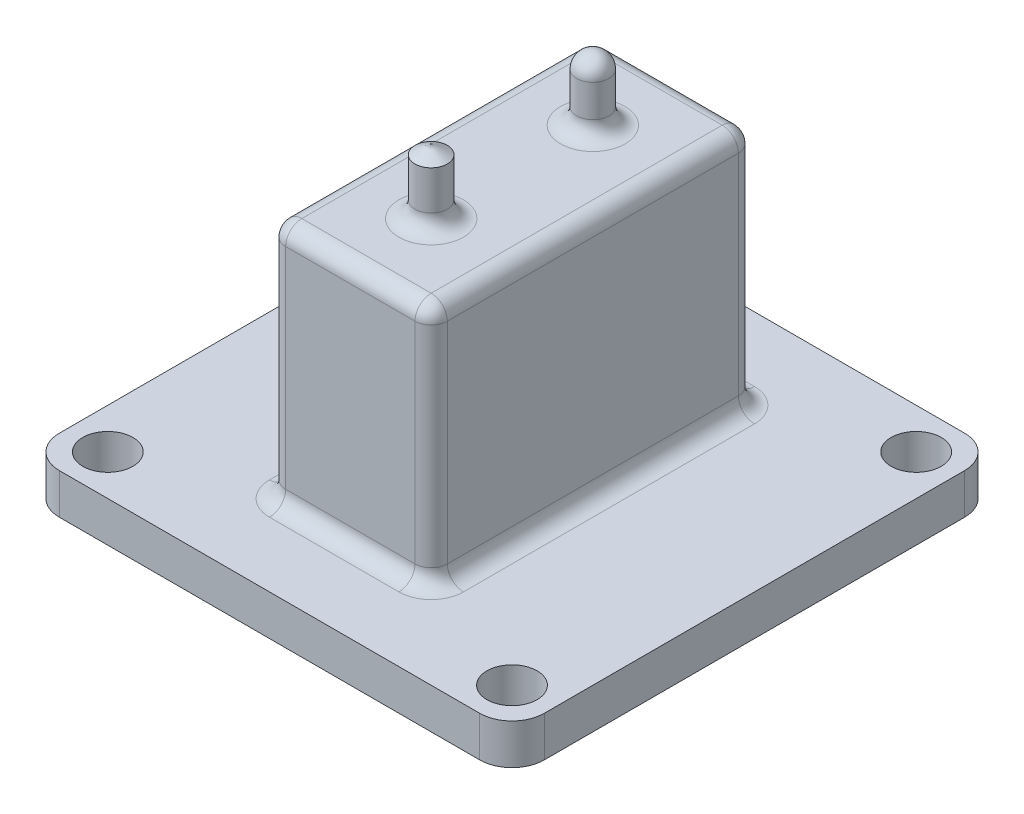
ISO-10303-21;
HEADER;
FILE_DESCRIPTION(('STEP AP214'),'2;1');
FILE_NAME('part.step','',(''),(''),'','','');
FILE_SCHEMA(('AUTOMOTIVE_DESIGN { 1 0 10303 214 1 1 1 1 }'));
ENDSEC;
DATA;
#1=APPLICATION_CONTEXT('core data for automotive mechanical design processes');
#2=APPLICATION_PROTOCOL_DEFINITION('international standard','automotive_design',2000,#1);
#3=PRODUCT_CONTEXT('',#1,'mechanical');
#4=PRODUCT('Part','Part','',(#3));
#5=PRODUCT_RELATED_PRODUCT_CATEGORY('part','',(#4));
#6=PRODUCT_DEFINITION_FORMATION('','',#4);
#7=PRODUCT_DEFINITION_CONTEXT('part definition',#1,'design');
#8=PRODUCT_DEFINITION('design','',#6,#7);
#9=PRODUCT_DEFINITION_SHAPE('','',#8);
#10=(LENGTH_UNIT() NAMED_UNIT(*) SI_UNIT(.MILLI.,.METRE.));
#11=(NAMED_UNIT(*) PLANE_ANGLE_UNIT() SI_UNIT($,.RADIAN.));
#12=(NAMED_UNIT(*) SI_UNIT($,.STERADIAN.) SOLID_ANGLE_UNIT());
#13=UNCERTAINTY_MEASURE_WITH_UNIT(LENGTH_MEASURE(1.E-05),#10,'distance_accuracy_value','');
#14=(GEOMETRIC_REPRESENTATION_CONTEXT(3) GLOBAL_UNCERTAINTY_ASSIGNED_CONTEXT((#13)) GLOBAL_UNIT_ASSIGNED_CONTEXT((#10,
#11,#12)) REPRESENTATION_CONTEXT('',''));
#15=CARTESIAN_POINT('',(0.,0.,0.));
#16=DIRECTION('',(0.,0.,1.));
#17=DIRECTION('',(1.,0.,0.));
#18=AXIS2_PLACEMENT_3D('',#15,#16,#17);
#19=CARTESIAN_POINT('',(0.,5.,0.));
#20=DIRECTION('',(0.,-1.,0.));
#21=DIRECTION('',(0.,0.,-1.));
#22=AXIS2_PLACEMENT_3D('',#19,#20,#21);
#23=PLANE('',#22);
#24=DIRECTION('',(0.,0.,-1.));
#25=VECTOR('',#24,1.);
#26=CARTESIAN_POINT('',(30.,5.,30.));
#27=LINE('',#26,#25);
#28=CARTESIAN_POINT('',(30.,5.,26.));
#29=VERTEX_POINT('',#28);
#30=CARTESIAN_POINT('',(30.,5.,-26.));
#31=VERTEX_POINT('',#30);
#32=EDGE_CURVE('E242',#29,#31,#27,.T.);
#33=ORIENTED_EDGE('',*,*,#32,.T.);
#34=CARTESIAN_POINT('',(26.,5.,-26.));
#35=DIRECTION('',(0.,-1.,0.));
#36=DIRECTION('',(0.,0.,-1.));
#37=AXIS2_PLACEMENT_3D('',#34,#35,#36);
#38=CIRCLE('',#37,4.);
#39=CARTESIAN_POINT('',(26.,5.,-30.));
#40=VERTEX_POINT('',#39);
#41=EDGE_CURVE('E328',#31,#40,#38,.F.);
#42=ORIENTED_EDGE('',*,*,#41,.T.);
#43=DIRECTION('',(-1.,0.,0.));
#44=VECTOR('',#43,1.);
#45=CARTESIAN_POINT('',(-30.,5.,-30.));
#46=LINE('',#45,#44);
#47=CARTESIAN_POINT('',(-26.,5.,-30.));
#48=VERTEX_POINT('',#47);
#49=EDGE_CURVE('E246',#40,#48,#46,.T.);
#50=ORIENTED_EDGE('',*,*,#49,.T.);
#51=CARTESIAN_POINT('',(-26.,5.,-26.));
#52=DIRECTION('',(0.,-1.,0.));
#53=DIRECTION('',(0.,0.,-1.));
#54=AXIS2_PLACEMENT_3D('',#51,#52,#53);
#55=CIRCLE('',#54,4.);
#56=CARTESIAN_POINT('',(-30.,5.,-26.));
#57=VERTEX_POINT('',#56);
#58=EDGE_CURVE('E325',#48,#57,#55,.F.);
#59=ORIENTED_EDGE('',*,*,#58,.T.);
#60=DIRECTION('',(0.,0.,1.));
#61=VECTOR('',#60,1.);
#62=CARTESIAN_POINT('',(-30.,5.,30.));
#63=LINE('',#62,#61);
#64=CARTESIAN_POINT('',(-30.,5.,26.));
#65=VERTEX_POINT('',#64);
#66=EDGE_CURVE('E251',#57,#65,#63,.T.);
#67=ORIENTED_EDGE('',*,*,#66,.T.);
#68=CARTESIAN_POINT('',(-26.,5.,26.));
#69=DIRECTION('',(0.,-1.,0.));
#70=DIRECTION('',(0.,0.,-1.));
#71=AXIS2_PLACEMENT_3D('',#68,#69,#70);
#72=CIRCLE('',#71,4.);
#73=CARTESIAN_POINT('',(-26.,5.,30.));
#74=VERTEX_POINT('',#73);
#75=EDGE_CURVE('E322',#65,#74,#72,.F.);
#76=ORIENTED_EDGE('',*,*,#75,.T.);
#77=DIRECTION('',(1.,0.,0.));
#78=VECTOR('',#77,1.);
#79=CARTESIAN_POINT('',(-30.,5.,30.));
#80=LINE('',#79,#78);
#81=CARTESIAN_POINT('',(26.,5.,30.));
#82=VERTEX_POINT('',#81);
#83=EDGE_CURVE('E255',#74,#82,#80,.T.);
#84=ORIENTED_EDGE('',*,*,#83,.T.);
#85=CARTESIAN_POINT('',(26.,5.,26.));
#86=DIRECTION('',(0.,-1.,0.));
#87=DIRECTION('',(0.,0.,-1.));
#88=AXIS2_PLACEMENT_3D('',#85,#86,#87);
#89=CIRCLE('',#88,4.);
#90=EDGE_CURVE('E319',#82,#29,#89,.F.);
#91=ORIENTED_EDGE('',*,*,#90,.T.);
#92=EDGE_LOOP('',(#33,#42,#50,#59,#67,#76,#84,#91));
#93=FACE_BOUND('',#92,.T.);
#94=CARTESIAN_POINT('',(-25.,5.,-25.));
#95=DIRECTION('',(0.,1.,0.));
#96=DIRECTION('',(0.,0.,1.));
#97=AXIS2_PLACEMENT_3D('',#94,#95,#96);
#98=CIRCLE('',#97,3.1);
#99=CARTESIAN_POINT('',(-25.,5.,-21.9));
#100=VERTEX_POINT('',#99);
#101=EDGE_CURVE('E234',#100,#100,#98,.T.);
#102=ORIENTED_EDGE('',*,*,#101,.F.);
#103=EDGE_LOOP('',(#102));
#104=FACE_BOUND('',#103,.T.);
#105=CARTESIAN_POINT('',(-25.,5.,25.));
#106=DIRECTION('',(0.,1.,0.));
#107=DIRECTION('',(0.,0.,1.));
#108=AXIS2_PLACEMENT_3D('',#105,#106,#107);
#109=CIRCLE('',#108,3.1);
#110=CARTESIAN_POINT('',(-25.,5.,28.1));
#111=VERTEX_POINT('',#110);
#112=EDGE_CURVE('E226',#111,#111,#109,.T.);
#113=ORIENTED_EDGE('',*,*,#112,.F.);
#114=EDGE_LOOP('',(#113));
#115=FACE_BOUND('',#114,.T.);
#116=CARTESIAN_POINT('',(25.,5.,25.));
#117=DIRECTION('',(0.,1.,0.));
#118=DIRECTION('',(0.,0.,1.));
#119=AXIS2_PLACEMENT_3D('',#116,#117,#118);
#120=CIRCLE('',#119,3.1);
#121=CARTESIAN_POINT('',(25.,5.,28.1));
#122=VERTEX_POINT('',#121);
#123=EDGE_CURVE('E218',#122,#122,#120,.T.);
#124=ORIENTED_EDGE('',*,*,#123,.F.);
#125=EDGE_LOOP('',(#124));
#126=FACE_BOUND('',#125,.T.);
#127=CARTESIAN_POINT('',(25.,5.,-25.));
#128=DIRECTION('',(0.,1.,0.));
#129=DIRECTION('',(0.,0.,1.));
#130=AXIS2_PLACEMENT_3D('',#127,#128,#129);
#131=CIRCLE('',#130,3.1);
#132=CARTESIAN_POINT('',(25.,5.,-21.9));
#133=VERTEX_POINT('',#132);
#134=EDGE_CURVE('E209',#133,#133,#131,.T.);
#135=ORIENTED_EDGE('',*,*,#134,.F.);
#136=EDGE_LOOP('',(#135));
#137=FACE_BOUND('',#136,.T.);
#138=CARTESIAN_POINT('',(-8.,5.,18.));
#139=DIRECTION('',(0.,-1.,0.));
#140=DIRECTION('',(0.,0.,-1.));
#141=AXIS2_PLACEMENT_3D('',#138,#139,#140);
#142=CIRCLE('',#141,4.);
#143=CARTESIAN_POINT('',(-12.,5.,18.));
#144=VERTEX_POINT('',#143);
#145=CARTESIAN_POINT('',(-8.,5.,22.));
#146=VERTEX_POINT('',#145);
#147=EDGE_CURVE('E11',#144,#146,#142,.F.);
#148=ORIENTED_EDGE('',*,*,#147,.F.);
#149=DIRECTION('',(0.,0.,1.));
#150=VECTOR('',#149,1.);
#151=CARTESIAN_POINT('',(-12.,5.,-20.));
#152=LINE('',#151,#150);
#153=CARTESIAN_POINT('',(-12.,5.,-18.));
#154=VERTEX_POINT('',#153);
#155=EDGE_CURVE('E52',#144,#154,#152,.F.);
#156=ORIENTED_EDGE('',*,*,#155,.T.);
#157=CARTESIAN_POINT('',(-8.,5.,-18.));
#158=DIRECTION('',(0.,-1.,0.));
#159=DIRECTION('',(0.,0.,-1.));
#160=AXIS2_PLACEMENT_3D('',#157,#158,#159);
#161=CIRCLE('',#160,4.);
#162=CARTESIAN_POINT('',(-8.,5.,-22.));
#163=VERTEX_POINT('',#162);
#164=EDGE_CURVE('E66',#163,#154,#161,.F.);
#165=ORIENTED_EDGE('',*,*,#164,.F.);
#166=DIRECTION('',(-1.,0.,0.));
#167=VECTOR('',#166,1.);
#168=CARTESIAN_POINT('',(10.,5.,-22.));
#169=LINE('',#168,#167);
#170=CARTESIAN_POINT('',(8.,5.,-22.));
#171=VERTEX_POINT('',#170);
#172=EDGE_CURVE('E424',#163,#171,#169,.F.);
#173=ORIENTED_EDGE('',*,*,#172,.T.);
#174=CARTESIAN_POINT('',(8.,5.,-18.));
#175=DIRECTION('',(0.,-1.,0.));
#176=DIRECTION('',(0.,0.,-1.));
#177=AXIS2_PLACEMENT_3D('',#174,#175,#176);
#178=CIRCLE('',#177,4.);
#179=CARTESIAN_POINT('',(12.,5.,-18.));
#180=VERTEX_POINT('',#179);
#181=EDGE_CURVE('E420',#180,#171,#178,.F.);
#182=ORIENTED_EDGE('',*,*,#181,.F.);
#183=DIRECTION('',(0.,0.,-1.));
#184=VECTOR('',#183,1.);
#185=CARTESIAN_POINT('',(12.,5.,20.));
#186=LINE('',#185,#184);
#187=CARTESIAN_POINT('',(12.,5.,18.));
#188=VERTEX_POINT('',#187);
#189=EDGE_CURVE('E414',#180,#188,#186,.F.);
#190=ORIENTED_EDGE('',*,*,#189,.T.);
#191=CARTESIAN_POINT('',(8.,5.,18.));
#192=DIRECTION('',(0.,-1.,0.));
#193=DIRECTION('',(0.,0.,-1.));
#194=AXIS2_PLACEMENT_3D('',#191,#192,#193);
#195=CIRCLE('',#194,4.);
#196=CARTESIAN_POINT('',(8.,5.,22.));
#197=VERTEX_POINT('',#196);
#198=EDGE_CURVE('E410',#197,#188,#195,.F.);
#199=ORIENTED_EDGE('',*,*,#198,.F.);
#200=DIRECTION('',(1.,0.,0.));
#201=VECTOR('',#200,1.);
#202=CARTESIAN_POINT('',(-10.,5.,22.));
#203=LINE('',#202,#201);
#204=EDGE_CURVE('E417',#197,#146,#203,.F.);
#205=ORIENTED_EDGE('',*,*,#204,.T.);
#206=EDGE_LOOP('',(#148,#156,#165,#173,#182,#190,#199,#205));
#207=FACE_BOUND('',#206,.T.);
#208=ADVANCED_FACE('F42',(#93,#104,#115,#126,#137,#207),#23,.F.);
#209=CARTESIAN_POINT('',(0.,43.,10.));
#210=DIRECTION('',(0.,-1.,0.));
#211=DIRECTION('',(0.,0.,-1.));
#212=AXIS2_PLACEMENT_3D('',#209,#210,#211);
#213=CYLINDRICAL_SURFACE('',#212,2.);
#214=CARTESIAN_POINT('',(0.,37.,10.));
#215=DIRECTION('',(0.,-1.,0.));
#216=DIRECTION('',(0.,0.,-1.));
#217=AXIS2_PLACEMENT_3D('',#214,#215,#216);
#218=CIRCLE('',#217,2.);
#219=CARTESIAN_POINT('',(0.,37.,8.));
#220=VERTEX_POINT('',#219);
#221=EDGE_CURVE('E289',#220,#220,#218,.F.);
#222=ORIENTED_EDGE('',*,*,#221,.T.);
#223=EDGE_LOOP('',(#222));
#224=FACE_BOUND('',#223,.T.);
#225=CARTESIAN_POINT('',(0.,41.8452994616207,10.));
#226=DIRECTION('',(0.,-1.,0.));
#227=DIRECTION('',(0.,0.,-1.));
#228=AXIS2_PLACEMENT_3D('',#225,#226,#227);
#229=CIRCLE('',#228,2.);
#230=CARTESIAN_POINT('',(0.,41.8452994616207,8.));
#231=VERTEX_POINT('',#230);
#232=EDGE_CURVE('E201',#231,#231,#229,.T.);
#233=ORIENTED_EDGE('',*,*,#232,.T.);
#234=EDGE_LOOP('',(#233));
#235=FACE_BOUND('',#234,.T.);
#236=ADVANCED_FACE('F616',(#224,#235),#213,.T.);
#237=CARTESIAN_POINT('',(0.,0.,0.));
#238=DIRECTION('',(0.,-1.,0.));
#239=DIRECTION('',(0.,0.,-1.));
#240=AXIS2_PLACEMENT_3D('',#237,#238,#239);
#241=PLANE('',#240);
#242=CARTESIAN_POINT('',(25.,0.,25.));
#243=DIRECTION('',(0.,1.,0.));
#244=DIRECTION('',(0.,0.,1.));
#245=AXIS2_PLACEMENT_3D('',#242,#243,#244);
#246=CIRCLE('',#245,3.1);
#247=CARTESIAN_POINT('',(25.,0.,28.1));
#248=VERTEX_POINT('',#247);
#249=EDGE_CURVE('E216',#248,#248,#246,.T.);
#250=ORIENTED_EDGE('',*,*,#249,.T.);
#251=EDGE_LOOP('',(#250));
#252=FACE_BOUND('',#251,.T.);
#253=CARTESIAN_POINT('',(-25.,0.,-25.));
#254=DIRECTION('',(0.,1.,0.));
#255=DIRECTION('',(0.,0.,1.));
#256=AXIS2_PLACEMENT_3D('',#253,#254,#255);
#257=CIRCLE('',#256,3.1);
#258=CARTESIAN_POINT('',(-25.,0.,-21.9));
#259=VERTEX_POINT('',#258);
#260=EDGE_CURVE('E230',#259,#259,#257,.T.);
#261=ORIENTED_EDGE('',*,*,#260,.T.);
#262=EDGE_LOOP('',(#261));
#263=FACE_BOUND('',#262,.T.);
#264=DIRECTION('',(-1.,0.,0.));
#265=VECTOR('',#264,1.);
#266=CARTESIAN_POINT('',(-30.,0.,-30.));
#267=LINE('',#266,#265);
#268=CARTESIAN_POINT('',(26.,0.,-30.));
#269=VERTEX_POINT('',#268);
#270=CARTESIAN_POINT('',(-26.,0.,-30.));
#271=VERTEX_POINT('',#270);
#272=EDGE_CURVE('E263',#269,#271,#267,.T.);
#273=ORIENTED_EDGE('',*,*,#272,.F.);
#274=CARTESIAN_POINT('',(26.,0.,-26.));
#275=DIRECTION('',(0.,-1.,0.));
#276=DIRECTION('',(0.,0.,-1.));
#277=AXIS2_PLACEMENT_3D('',#274,#275,#276);
#278=CIRCLE('',#277,4.);
#279=CARTESIAN_POINT('',(30.,0.,-26.));
#280=VERTEX_POINT('',#279);
#281=EDGE_CURVE('E309',#269,#280,#278,.T.);
#282=ORIENTED_EDGE('',*,*,#281,.T.);
#283=DIRECTION('',(0.,0.,-1.));
#284=VECTOR('',#283,1.);
#285=CARTESIAN_POINT('',(30.,0.,30.));
#286=LINE('',#285,#284);
#287=CARTESIAN_POINT('',(30.,0.,26.));
#288=VERTEX_POINT('',#287);
#289=EDGE_CURVE('E238',#288,#280,#286,.T.);
#290=ORIENTED_EDGE('',*,*,#289,.F.);
#291=CARTESIAN_POINT('',(26.,0.,26.));
#292=DIRECTION('',(0.,-1.,0.));
#293=DIRECTION('',(0.,0.,-1.));
#294=AXIS2_PLACEMENT_3D('',#291,#292,#293);
#295=CIRCLE('',#294,4.);
#296=CARTESIAN_POINT('',(26.,0.,30.));
#297=VERTEX_POINT('',#296);
#298=EDGE_CURVE('E300',#288,#297,#295,.T.);
#299=ORIENTED_EDGE('',*,*,#298,.T.);
#300=DIRECTION('',(1.,0.,0.));
#301=VECTOR('',#300,1.);
#302=CARTESIAN_POINT('',(-30.,0.,30.));
#303=LINE('',#302,#301);
#304=CARTESIAN_POINT('',(-26.,0.,30.));
#305=VERTEX_POINT('',#304);
#306=EDGE_CURVE('E247',#305,#297,#303,.T.);
#307=ORIENTED_EDGE('',*,*,#306,.F.);
#308=CARTESIAN_POINT('',(-26.,0.,26.));
#309=DIRECTION('',(0.,-1.,0.));
#310=DIRECTION('',(0.,0.,-1.));
#311=AXIS2_PLACEMENT_3D('',#308,#309,#310);
#312=CIRCLE('',#311,4.);
#313=CARTESIAN_POINT('',(-30.,0.,26.));
#314=VERTEX_POINT('',#313);
#315=EDGE_CURVE('E303',#305,#314,#312,.T.);
#316=ORIENTED_EDGE('',*,*,#315,.T.);
#317=DIRECTION('',(0.,0.,1.));
#318=VECTOR('',#317,1.);
#319=CARTESIAN_POINT('',(-30.,0.,30.));
#320=LINE('',#319,#318);
#321=CARTESIAN_POINT('',(-30.,0.,-26.));
#322=VERTEX_POINT('',#321);
#323=EDGE_CURVE('E267',#322,#314,#320,.T.);
#324=ORIENTED_EDGE('',*,*,#323,.F.);
#325=CARTESIAN_POINT('',(-26.,0.,-26.));
#326=DIRECTION('',(0.,-1.,0.));
#327=DIRECTION('',(0.,0.,-1.));
#328=AXIS2_PLACEMENT_3D('',#325,#326,#327);
#329=CIRCLE('',#328,4.);
#330=EDGE_CURVE('E306',#322,#271,#329,.T.);
#331=ORIENTED_EDGE('',*,*,#330,.T.);
#332=EDGE_LOOP('',(#273,#282,#290,#299,#307,#316,#324,#331));
#333=FACE_BOUND('',#332,.T.);
#334=CARTESIAN_POINT('',(-25.,0.,25.));
#335=DIRECTION('',(0.,1.,0.));
#336=DIRECTION('',(0.,0.,1.));
#337=AXIS2_PLACEMENT_3D('',#334,#335,#336);
#338=CIRCLE('',#337,3.1);
#339=CARTESIAN_POINT('',(-25.,0.,28.1));
#340=VERTEX_POINT('',#339);
#341=EDGE_CURVE('E222',#340,#340,#338,.T.);
#342=ORIENTED_EDGE('',*,*,#341,.T.);
#343=EDGE_LOOP('',(#342));
#344=FACE_BOUND('',#343,.T.);
#345=CARTESIAN_POINT('',(25.,0.,-25.));
#346=DIRECTION('',(0.,1.,0.));
#347=DIRECTION('',(0.,0.,1.));
#348=AXIS2_PLACEMENT_3D('',#345,#346,#347);
#349=CIRCLE('',#348,3.1);
#350=CARTESIAN_POINT('',(25.,0.,-21.9));
#351=VERTEX_POINT('',#350);
#352=EDGE_CURVE('E204',#351,#351,#349,.T.);
#353=ORIENTED_EDGE('',*,*,#352,.T.);
#354=EDGE_LOOP('',(#353));
#355=FACE_BOUND('',#354,.T.);
#356=ADVANCED_FACE('F624',(#252,#263,#333,#344,#355),#241,.T.);
#357=CARTESIAN_POINT('',(30.,5.,30.));
#358=DIRECTION('',(-1.,0.,0.));
#359=DIRECTION('',(0.,0.,1.));
#360=AXIS2_PLACEMENT_3D('',#357,#358,#359);
#361=PLANE('',#360);
#362=ORIENTED_EDGE('',*,*,#289,.T.);
#363=DIRECTION('',(0.,-1.,0.));
#364=VECTOR('',#363,1.);
#365=CARTESIAN_POINT('',(30.,5.,-26.));
#366=LINE('',#365,#364);
#367=EDGE_CURVE('E316',#280,#31,#366,.F.);
#368=ORIENTED_EDGE('',*,*,#367,.T.);
#369=ORIENTED_EDGE('',*,*,#32,.F.);
#370=DIRECTION('',(0.,-1.,0.));
#371=VECTOR('',#370,1.);
#372=CARTESIAN_POINT('',(30.,5.,26.));
#373=LINE('',#372,#371);
#374=EDGE_CURVE('E312',#29,#288,#373,.T.);
#375=ORIENTED_EDGE('',*,*,#374,.T.);
#376=EDGE_LOOP('',(#362,#368,#369,#375));
#377=FACE_BOUND('',#376,.T.);
#378=ADVANCED_FACE('F634',(#377),#361,.F.);
#379=CARTESIAN_POINT('',(-30.,5.,-30.));
#380=DIRECTION('',(0.,0.,1.));
#381=DIRECTION('',(1.,0.,0.));
#382=AXIS2_PLACEMENT_3D('',#379,#380,#381);
#383=PLANE('',#382);
#384=ORIENTED_EDGE('',*,*,#49,.F.);
#385=DIRECTION('',(0.,-1.,0.));
#386=VECTOR('',#385,1.);
#387=CARTESIAN_POINT('',(26.,5.,-30.));
#388=LINE('',#387,#386);
#389=EDGE_CURVE('E296',#40,#269,#388,.T.);
#390=ORIENTED_EDGE('',*,*,#389,.T.);
#391=ORIENTED_EDGE('',*,*,#272,.T.);
#392=DIRECTION('',(0.,-1.,0.));
#393=VECTOR('',#392,1.);
#394=CARTESIAN_POINT('',(-26.,5.,-30.));
#395=LINE('',#394,#393);
#396=EDGE_CURVE('E293',#271,#48,#395,.F.);
#397=ORIENTED_EDGE('',*,*,#396,.T.);
#398=EDGE_LOOP('',(#384,#390,#391,#397));
#399=FACE_BOUND('',#398,.T.);
#400=ADVANCED_FACE('F643',(#399),#383,.F.);
#401=CARTESIAN_POINT('',(-30.,5.,30.));
#402=DIRECTION('',(1.,0.,0.));
#403=DIRECTION('',(0.,0.,-1.));
#404=AXIS2_PLACEMENT_3D('',#401,#402,#403);
#405=PLANE('',#404);
#406=ORIENTED_EDGE('',*,*,#66,.F.);
#407=DIRECTION('',(0.,-1.,0.));
#408=VECTOR('',#407,1.);
#409=CARTESIAN_POINT('',(-30.,5.,-26.));
#410=LINE('',#409,#408);
#411=EDGE_CURVE('E334',#57,#322,#410,.T.);
#412=ORIENTED_EDGE('',*,*,#411,.T.);
#413=ORIENTED_EDGE('',*,*,#323,.T.);
#414=DIRECTION('',(0.,-1.,0.));
#415=VECTOR('',#414,1.);
#416=CARTESIAN_POINT('',(-30.,5.,26.));
#417=LINE('',#416,#415);
#418=EDGE_CURVE('E331',#314,#65,#417,.F.);
#419=ORIENTED_EDGE('',*,*,#418,.T.);
#420=EDGE_LOOP('',(#406,#412,#413,#419));
#421=FACE_BOUND('',#420,.T.);
#422=ADVANCED_FACE('F639',(#421),#405,.F.);
#423=CARTESIAN_POINT('',(-30.,5.,30.));
#424=DIRECTION('',(0.,0.,-1.));
#425=DIRECTION('',(-1.,0.,0.));
#426=AXIS2_PLACEMENT_3D('',#423,#424,#425);
#427=PLANE('',#426);
#428=ORIENTED_EDGE('',*,*,#83,.F.);
#429=DIRECTION('',(0.,-1.,0.));
#430=VECTOR('',#429,1.);
#431=CARTESIAN_POINT('',(-26.,5.,30.));
#432=LINE('',#431,#430);
#433=EDGE_CURVE('E341',#74,#305,#432,.T.);
#434=ORIENTED_EDGE('',*,*,#433,.T.);
#435=ORIENTED_EDGE('',*,*,#306,.T.);
#436=DIRECTION('',(0.,-1.,0.));
#437=VECTOR('',#436,1.);
#438=CARTESIAN_POINT('',(26.,5.,30.));
#439=LINE('',#438,#437);
#440=EDGE_CURVE('E338',#297,#82,#439,.F.);
#441=ORIENTED_EDGE('',*,*,#440,.T.);
#442=EDGE_LOOP('',(#428,#434,#435,#441));
#443=FACE_BOUND('',#442,.T.);
#444=ADVANCED_FACE('F636',(#443),#427,.F.);
#445=CARTESIAN_POINT('',(-25.,5.,-25.));
#446=DIRECTION('',(0.,-1.,0.));
#447=DIRECTION('',(0.,0.,-1.));
#448=AXIS2_PLACEMENT_3D('',#445,#446,#447);
#449=CYLINDRICAL_SURFACE('',#448,3.1);
#450=ORIENTED_EDGE('',*,*,#101,.T.);
#451=EDGE_LOOP('',(#450));
#452=FACE_BOUND('',#451,.T.);
#453=ORIENTED_EDGE('',*,*,#260,.F.);
#454=EDGE_LOOP('',(#453));
#455=FACE_BOUND('',#454,.T.);
#456=ADVANCED_FACE('F630',(#452,#455),#449,.F.);
#457=CARTESIAN_POINT('',(-25.,5.,25.));
#458=DIRECTION('',(0.,-1.,0.));
#459=DIRECTION('',(0.,0.,-1.));
#460=AXIS2_PLACEMENT_3D('',#457,#458,#459);
#461=CYLINDRICAL_SURFACE('',#460,3.1);
#462=ORIENTED_EDGE('',*,*,#112,.T.);
#463=EDGE_LOOP('',(#462));
#464=FACE_BOUND('',#463,.T.);
#465=ORIENTED_EDGE('',*,*,#341,.F.);
#466=EDGE_LOOP('',(#465));
#467=FACE_BOUND('',#466,.T.);
#468=ADVANCED_FACE('F1001',(#464,#467),#461,.F.);
#469=CARTESIAN_POINT('',(25.,5.,25.));
#470=DIRECTION('',(0.,-1.,0.));
#471=DIRECTION('',(0.,0.,-1.));
#472=AXIS2_PLACEMENT_3D('',#469,#470,#471);
#473=CYLINDRICAL_SURFACE('',#472,3.1);
#474=ORIENTED_EDGE('',*,*,#123,.T.);
#475=EDGE_LOOP('',(#474));
#476=FACE_BOUND('',#475,.T.);
#477=ORIENTED_EDGE('',*,*,#249,.F.);
#478=EDGE_LOOP('',(#477));
#479=FACE_BOUND('',#478,.T.);
#480=ADVANCED_FACE('F990',(#476,#479),#473,.F.);
#481=CARTESIAN_POINT('',(25.,5.,-25.));
#482=DIRECTION('',(0.,-1.,0.));
#483=DIRECTION('',(0.,0.,-1.));
#484=AXIS2_PLACEMENT_3D('',#481,#482,#483);
#485=CYLINDRICAL_SURFACE('',#484,3.1);
#486=ORIENTED_EDGE('',*,*,#134,.T.);
#487=EDGE_LOOP('',(#486));
#488=FACE_BOUND('',#487,.T.);
#489=ORIENTED_EDGE('',*,*,#352,.F.);
#490=EDGE_LOOP('',(#489));
#491=FACE_BOUND('',#490,.T.);
#492=ADVANCED_FACE('F981',(#488,#491),#485,.F.);
#493=CARTESIAN_POINT('',(10.,35.,20.));
#494=DIRECTION('',(-1.,0.,0.));
#495=DIRECTION('',(0.,0.,1.));
#496=AXIS2_PLACEMENT_3D('',#493,#494,#495);
#497=PLANE('',#496);
#498=DIRECTION('',(0.,-1.,0.));
#499=VECTOR('',#498,1.);
#500=CARTESIAN_POINT('',(10.,35.,-18.));
#501=LINE('',#500,#499);
#502=CARTESIAN_POINT('',(10.,7.,-18.));
#503=VERTEX_POINT('',#502);
#504=CARTESIAN_POINT('',(10.,33.,-18.));
#505=VERTEX_POINT('',#504);
#506=EDGE_CURVE('E364',#503,#505,#501,.F.);
#507=ORIENTED_EDGE('',*,*,#506,.T.);
#508=DIRECTION('',(0.,0.,-1.));
#509=VECTOR('',#508,1.);
#510=CARTESIAN_POINT('',(10.,33.,20.));
#511=LINE('',#510,#509);
#512=CARTESIAN_POINT('',(10.,33.,18.));
#513=VERTEX_POINT('',#512);
#514=EDGE_CURVE('E368',#505,#513,#511,.F.);
#515=ORIENTED_EDGE('',*,*,#514,.T.);
#516=DIRECTION('',(0.,-1.,0.));
#517=VECTOR('',#516,1.);
#518=CARTESIAN_POINT('',(10.,35.,18.));
#519=LINE('',#518,#517);
#520=CARTESIAN_POINT('',(10.,7.,18.));
#521=VERTEX_POINT('',#520);
#522=EDGE_CURVE('E361',#513,#521,#519,.T.);
#523=ORIENTED_EDGE('',*,*,#522,.T.);
#524=DIRECTION('',(0.,0.,-1.));
#525=VECTOR('',#524,1.);
#526=CARTESIAN_POINT('',(10.,7.,-20.));
#527=LINE('',#526,#525);
#528=EDGE_CURVE('E358',#521,#503,#527,.T.);
#529=ORIENTED_EDGE('',*,*,#528,.T.);
#530=EDGE_LOOP('',(#507,#515,#523,#529));
#531=FACE_BOUND('',#530,.T.);
#532=ADVANCED_FACE('F594',(#531),#497,.F.);
#533=CARTESIAN_POINT('',(-10.,35.,-20.));
#534=DIRECTION('',(0.,0.,1.));
#535=DIRECTION('',(1.,0.,0.));
#536=AXIS2_PLACEMENT_3D('',#533,#534,#535);
#537=PLANE('',#536);
#538=DIRECTION('',(0.,-1.,0.));
#539=VECTOR('',#538,1.);
#540=CARTESIAN_POINT('',(-8.,35.,-20.));
#541=LINE('',#540,#539);
#542=CARTESIAN_POINT('',(-8.,7.,-20.));
#543=VERTEX_POINT('',#542);
#544=CARTESIAN_POINT('',(-8.,33.,-20.));
#545=VERTEX_POINT('',#544);
#546=EDGE_CURVE('E348',#543,#545,#541,.F.);
#547=ORIENTED_EDGE('',*,*,#546,.T.);
#548=DIRECTION('',(-1.,0.,0.));
#549=VECTOR('',#548,1.);
#550=CARTESIAN_POINT('',(-10.,33.,-20.));
#551=LINE('',#550,#549);
#552=CARTESIAN_POINT('',(8.,33.,-20.));
#553=VERTEX_POINT('',#552);
#554=EDGE_CURVE('E355',#545,#553,#551,.F.);
#555=ORIENTED_EDGE('',*,*,#554,.T.);
#556=DIRECTION('',(0.,-1.,0.));
#557=VECTOR('',#556,1.);
#558=CARTESIAN_POINT('',(8.,35.,-20.));
#559=LINE('',#558,#557);
#560=CARTESIAN_POINT('',(8.,7.,-20.));
#561=VERTEX_POINT('',#560);
#562=EDGE_CURVE('E351',#553,#561,#559,.T.);
#563=ORIENTED_EDGE('',*,*,#562,.T.);
#564=DIRECTION('',(-1.,0.,0.));
#565=VECTOR('',#564,1.);
#566=CARTESIAN_POINT('',(-10.,7.,-20.));
#567=LINE('',#566,#565);
#568=EDGE_CURVE('E345',#561,#543,#567,.T.);
#569=ORIENTED_EDGE('',*,*,#568,.T.);
#570=EDGE_LOOP('',(#547,#555,#563,#569));
#571=FACE_BOUND('',#570,.T.);
#572=ADVANCED_FACE('F586',(#571),#537,.F.);
#573=CARTESIAN_POINT('',(-10.,35.,20.));
#574=DIRECTION('',(1.,0.,0.));
#575=DIRECTION('',(0.,0.,-1.));
#576=AXIS2_PLACEMENT_3D('',#573,#574,#575);
#577=PLANE('',#576);
#578=DIRECTION('',(0.,-1.,0.));
#579=VECTOR('',#578,1.);
#580=CARTESIAN_POINT('',(-10.,35.,18.));
#581=LINE('',#580,#579);
#582=CARTESIAN_POINT('',(-10.,7.,18.));
#583=VERTEX_POINT('',#582);
#584=CARTESIAN_POINT('',(-10.,33.,18.));
#585=VERTEX_POINT('',#584);
#586=EDGE_CURVE('E374',#583,#585,#581,.F.);
#587=ORIENTED_EDGE('',*,*,#586,.T.);
#588=DIRECTION('',(0.,0.,1.));
#589=VECTOR('',#588,1.);
#590=CARTESIAN_POINT('',(-10.,33.,20.));
#591=LINE('',#590,#589);
#592=CARTESIAN_POINT('',(-10.,33.,-18.));
#593=VERTEX_POINT('',#592);
#594=EDGE_CURVE('E381',#585,#593,#591,.F.);
#595=ORIENTED_EDGE('',*,*,#594,.T.);
#596=DIRECTION('',(0.,-1.,0.));
#597=VECTOR('',#596,1.);
#598=CARTESIAN_POINT('',(-10.,35.,-18.));
#599=LINE('',#598,#597);
#600=CARTESIAN_POINT('',(-10.,7.,-18.));
#601=VERTEX_POINT('',#600);
#602=EDGE_CURVE('E377',#593,#601,#599,.T.);
#603=ORIENTED_EDGE('',*,*,#602,.T.);
#604=DIRECTION('',(0.,0.,1.));
#605=VECTOR('',#604,1.);
#606=CARTESIAN_POINT('',(-10.,7.,20.));
#607=LINE('',#606,#605);
#608=EDGE_CURVE('E371',#601,#583,#607,.T.);
#609=ORIENTED_EDGE('',*,*,#608,.T.);
#610=EDGE_LOOP('',(#587,#595,#603,#609));
#611=FACE_BOUND('',#610,.T.);
#612=ADVANCED_FACE('F579',(#611),#577,.F.);
#613=CARTESIAN_POINT('',(-10.,35.,20.));
#614=DIRECTION('',(0.,0.,-1.));
#615=DIRECTION('',(-1.,0.,0.));
#616=AXIS2_PLACEMENT_3D('',#613,#614,#615);
#617=PLANE('',#616);
#618=DIRECTION('',(0.,-1.,0.));
#619=VECTOR('',#618,1.);
#620=CARTESIAN_POINT('',(8.,35.,20.));
#621=LINE('',#620,#619);
#622=CARTESIAN_POINT('',(8.,7.,20.));
#623=VERTEX_POINT('',#622);
#624=CARTESIAN_POINT('',(8.,33.,20.));
#625=VERTEX_POINT('',#624);
#626=EDGE_CURVE('E387',#623,#625,#621,.F.);
#627=ORIENTED_EDGE('',*,*,#626,.T.);
#628=DIRECTION('',(1.,0.,0.));
#629=VECTOR('',#628,1.);
#630=CARTESIAN_POINT('',(-10.,33.,20.));
#631=LINE('',#630,#629);
#632=CARTESIAN_POINT('',(-8.,33.,20.));
#633=VERTEX_POINT('',#632);
#634=EDGE_CURVE('E394',#625,#633,#631,.F.);
#635=ORIENTED_EDGE('',*,*,#634,.T.);
#636=DIRECTION('',(0.,-1.,0.));
#637=VECTOR('',#636,1.);
#638=CARTESIAN_POINT('',(-8.,35.,20.));
#639=LINE('',#638,#637);
#640=CARTESIAN_POINT('',(-8.,7.,20.));
#641=VERTEX_POINT('',#640);
#642=EDGE_CURVE('E390',#633,#641,#639,.T.);
#643=ORIENTED_EDGE('',*,*,#642,.T.);
#644=DIRECTION('',(1.,0.,0.));
#645=VECTOR('',#644,1.);
#646=CARTESIAN_POINT('',(10.,7.,20.));
#647=LINE('',#646,#645);
#648=EDGE_CURVE('E384',#641,#623,#647,.T.);
#649=ORIENTED_EDGE('',*,*,#648,.T.);
#650=EDGE_LOOP('',(#627,#635,#643,#649));
#651=FACE_BOUND('',#650,.T.);
#652=ADVANCED_FACE('F553',(#651),#617,.F.);
#653=CARTESIAN_POINT('',(0.,35.,0.));
#654=DIRECTION('',(0.,-1.,0.));
#655=DIRECTION('',(0.,0.,-1.));
#656=AXIS2_PLACEMENT_3D('',#653,#654,#655);
#657=PLANE('',#656);
#658=DIRECTION('',(0.,0.,-1.));
#659=VECTOR('',#658,1.);
#660=CARTESIAN_POINT('',(8.,35.,0.));
#661=LINE('',#660,#659);
#662=CARTESIAN_POINT('',(8.,35.,18.));
#663=VERTEX_POINT('',#662);
#664=CARTESIAN_POINT('',(8.,35.,-18.));
#665=VERTEX_POINT('',#664);
#666=EDGE_CURVE('E397',#663,#665,#661,.T.);
#667=ORIENTED_EDGE('',*,*,#666,.T.);
#668=DIRECTION('',(-1.,0.,0.));
#669=VECTOR('',#668,1.);
#670=CARTESIAN_POINT('',(0.,35.,-18.));
#671=LINE('',#670,#669);
#672=CARTESIAN_POINT('',(-8.,35.,-18.));
#673=VERTEX_POINT('',#672);
#674=EDGE_CURVE('E406',#665,#673,#671,.T.);
#675=ORIENTED_EDGE('',*,*,#674,.T.);
#676=DIRECTION('',(0.,0.,1.));
#677=VECTOR('',#676,1.);
#678=CARTESIAN_POINT('',(-8.,35.,0.));
#679=LINE('',#678,#677);
#680=CARTESIAN_POINT('',(-8.,35.,18.));
#681=VERTEX_POINT('',#680);
#682=EDGE_CURVE('E403',#673,#681,#679,.T.);
#683=ORIENTED_EDGE('',*,*,#682,.T.);
#684=DIRECTION('',(1.,0.,0.));
#685=VECTOR('',#684,1.);
#686=CARTESIAN_POINT('',(0.,35.,18.));
#687=LINE('',#686,#685);
#688=EDGE_CURVE('E400',#681,#663,#687,.T.);
#689=ORIENTED_EDGE('',*,*,#688,.T.);
#690=EDGE_LOOP('',(#667,#675,#683,#689));
#691=FACE_BOUND('',#690,.T.);
#692=CARTESIAN_POINT('',(0.,35.,-10.));
#693=DIRECTION('',(0.,-1.,0.));
#694=DIRECTION('',(0.,0.,-1.));
#695=AXIS2_PLACEMENT_3D('',#692,#693,#694);
#696=CIRCLE('',#695,4.);
#697=CARTESIAN_POINT('',(0.,35.,-14.));
#698=VERTEX_POINT('',#697);
#699=EDGE_CURVE('E285',#698,#698,#696,.T.);
#700=ORIENTED_EDGE('',*,*,#699,.T.);
#701=EDGE_LOOP('',(#700));
#702=FACE_BOUND('',#701,.T.);
#703=CARTESIAN_POINT('',(0.,35.,10.));
#704=DIRECTION('',(0.,-1.,0.));
#705=DIRECTION('',(0.,0.,-1.));
#706=AXIS2_PLACEMENT_3D('',#703,#704,#705);
#707=CIRCLE('',#706,4.);
#708=CARTESIAN_POINT('',(0.,35.,6.));
#709=VERTEX_POINT('',#708);
#710=EDGE_CURVE('E281',#709,#709,#707,.T.);
#711=ORIENTED_EDGE('',*,*,#710,.T.);
#712=EDGE_LOOP('',(#711));
#713=FACE_BOUND('',#712,.T.);
#714=ADVANCED_FACE('F601',(#691,#702,#713),#657,.F.);
#715=CARTESIAN_POINT('',(0.,43.,-10.));
#716=DIRECTION('',(0.,-1.,0.));
#717=DIRECTION('',(0.,0.,-1.));
#718=AXIS2_PLACEMENT_3D('',#715,#716,#717);
#719=CYLINDRICAL_SURFACE('',#718,2.);
#720=CARTESIAN_POINT('',(0.,37.,-10.));
#721=DIRECTION('',(0.,-1.,0.));
#722=DIRECTION('',(0.,0.,-1.));
#723=AXIS2_PLACEMENT_3D('',#720,#721,#722);
#724=CIRCLE('',#723,2.);
#725=CARTESIAN_POINT('',(0.,37.,-12.));
#726=VERTEX_POINT('',#725);
#727=EDGE_CURVE('E277',#726,#726,#724,.F.);
#728=ORIENTED_EDGE('',*,*,#727,.T.);
#729=EDGE_LOOP('',(#728));
#730=FACE_BOUND('',#729,.T.);
#731=CARTESIAN_POINT('',(0.,41.,-10.));
#732=DIRECTION('',(0.,-1.,0.));
#733=DIRECTION('',(0.,0.,-1.));
#734=AXIS2_PLACEMENT_3D('',#731,#732,#733);
#735=CIRCLE('',#734,2.);
#736=CARTESIAN_POINT('',(0.,41.,-12.));
#737=VERTEX_POINT('',#736);
#738=EDGE_CURVE('E259',#737,#737,#735,.T.);
#739=ORIENTED_EDGE('',*,*,#738,.T.);
#740=EDGE_LOOP('',(#739));
#741=FACE_BOUND('',#740,.T.);
#742=ADVANCED_FACE('F655',(#730,#741),#719,.T.);
#743=CARTESIAN_POINT('',(0.,37.,-10.));
#744=DIRECTION('',(0.,-1.,0.));
#745=DIRECTION('',(0.,0.,-1.));
#746=AXIS2_PLACEMENT_3D('',#743,#744,#745);
#747=TOROIDAL_SURFACE('',#746,4.,2.);
#748=ORIENTED_EDGE('',*,*,#699,.F.);
#749=EDGE_LOOP('',(#748));
#750=FACE_BOUND('',#749,.T.);
#751=ORIENTED_EDGE('',*,*,#727,.F.);
#752=EDGE_LOOP('',(#751));
#753=FACE_BOUND('',#752,.T.);
#754=ADVANCED_FACE('F651',(#750,#753),#747,.F.);
#755=CARTESIAN_POINT('',(0.,37.,10.));
#756=DIRECTION('',(0.,-1.,0.));
#757=DIRECTION('',(0.,0.,-1.));
#758=AXIS2_PLACEMENT_3D('',#755,#756,#757);
#759=TOROIDAL_SURFACE('',#758,4.,2.);
#760=ORIENTED_EDGE('',*,*,#710,.F.);
#761=EDGE_LOOP('',(#760));
#762=FACE_BOUND('',#761,.T.);
#763=ORIENTED_EDGE('',*,*,#221,.F.);
#764=EDGE_LOOP('',(#763));
#765=FACE_BOUND('',#764,.T.);
#766=ADVANCED_FACE('F654',(#762,#765),#759,.F.);
#767=CARTESIAN_POINT('',(0.,41.,-10.));
#768=DIRECTION('',(0.,1.,0.));
#769=DIRECTION('',(0.,0.,1.));
#770=AXIS2_PLACEMENT_3D('',#767,#768,#769);
#771=SPHERICAL_SURFACE('',#770,2.);
#772=ORIENTED_EDGE('',*,*,#738,.F.);
#773=EDGE_LOOP('',(#772));
#774=FACE_BOUND('',#773,.T.);
#775=ADVANCED_FACE('F659',(#774),#771,.T.);
#776=CARTESIAN_POINT('',(26.,5.,-26.));
#777=DIRECTION('',(0.,-1.,0.));
#778=DIRECTION('',(0.,0.,-1.));
#779=AXIS2_PLACEMENT_3D('',#776,#777,#778);
#780=CYLINDRICAL_SURFACE('',#779,4.);
#781=ORIENTED_EDGE('',*,*,#41,.F.);
#782=ORIENTED_EDGE('',*,*,#367,.F.);
#783=ORIENTED_EDGE('',*,*,#281,.F.);
#784=ORIENTED_EDGE('',*,*,#389,.F.);
#785=EDGE_LOOP('',(#781,#782,#783,#784));
#786=FACE_BOUND('',#785,.T.);
#787=ADVANCED_FACE('F663',(#786),#780,.T.);
#788=CARTESIAN_POINT('',(-26.,5.,-26.));
#789=DIRECTION('',(0.,-1.,0.));
#790=DIRECTION('',(0.,0.,-1.));
#791=AXIS2_PLACEMENT_3D('',#788,#789,#790);
#792=CYLINDRICAL_SURFACE('',#791,4.);
#793=ORIENTED_EDGE('',*,*,#58,.F.);
#794=ORIENTED_EDGE('',*,*,#396,.F.);
#795=ORIENTED_EDGE('',*,*,#330,.F.);
#796=ORIENTED_EDGE('',*,*,#411,.F.);
#797=EDGE_LOOP('',(#793,#794,#795,#796));
#798=FACE_BOUND('',#797,.T.);
#799=ADVANCED_FACE('F667',(#798),#792,.T.);
#800=CARTESIAN_POINT('',(-26.,5.,26.));
#801=DIRECTION('',(0.,-1.,0.));
#802=DIRECTION('',(0.,0.,-1.));
#803=AXIS2_PLACEMENT_3D('',#800,#801,#802);
#804=CYLINDRICAL_SURFACE('',#803,4.);
#805=ORIENTED_EDGE('',*,*,#75,.F.);
#806=ORIENTED_EDGE('',*,*,#418,.F.);
#807=ORIENTED_EDGE('',*,*,#315,.F.);
#808=ORIENTED_EDGE('',*,*,#433,.F.);
#809=EDGE_LOOP('',(#805,#806,#807,#808));
#810=FACE_BOUND('',#809,.T.);
#811=ADVANCED_FACE('F671',(#810),#804,.T.);
#812=CARTESIAN_POINT('',(26.,5.,26.));
#813=DIRECTION('',(0.,-1.,0.));
#814=DIRECTION('',(0.,0.,-1.));
#815=AXIS2_PLACEMENT_3D('',#812,#813,#814);
#816=CYLINDRICAL_SURFACE('',#815,4.);
#817=ORIENTED_EDGE('',*,*,#90,.F.);
#818=ORIENTED_EDGE('',*,*,#440,.F.);
#819=ORIENTED_EDGE('',*,*,#298,.F.);
#820=ORIENTED_EDGE('',*,*,#374,.F.);
#821=EDGE_LOOP('',(#817,#818,#819,#820));
#822=FACE_BOUND('',#821,.T.);
#823=ADVANCED_FACE('F197',(#822),#816,.T.);
#824=CARTESIAN_POINT('',(0.,41.8452994616207,10.));
#825=DIRECTION('',(0.,-1.,0.));
#826=DIRECTION('',(0.,0.,-1.));
#827=AXIS2_PLACEMENT_3D('',#824,#825,#826);
#828=CONICAL_SURFACE('',#827,2.,1.0471975511966);
#829=CARTESIAN_POINT('',(0.,43.,10.));
#830=VERTEX_POINT('',#829);
#831=VERTEX_LOOP('',#830);
#832=FACE_BOUND('',#831,.T.);
#833=ORIENTED_EDGE('',*,*,#232,.F.);
#834=EDGE_LOOP('',(#833));
#835=FACE_BOUND('',#834,.T.);
#836=ADVANCED_FACE('F194',(#832,#835),#828,.T.);
#837=CARTESIAN_POINT('',(-8.,35.,18.));
#838=DIRECTION('',(0.,-1.,0.));
#839=DIRECTION('',(0.,0.,-1.));
#840=AXIS2_PLACEMENT_3D('',#837,#838,#839);
#841=CYLINDRICAL_SURFACE('',#840,2.);
#842=CARTESIAN_POINT('',(-8.,33.,18.));
#843=DIRECTION('',(0.,1.,0.));
#844=DIRECTION('',(0.,0.,1.));
#845=AXIS2_PLACEMENT_3D('',#842,#843,#844);
#846=CIRCLE('',#845,2.);
#847=EDGE_CURVE('E46',#585,#633,#846,.T.);
#848=ORIENTED_EDGE('',*,*,#847,.F.);
#849=ORIENTED_EDGE('',*,*,#586,.F.);
#850=CARTESIAN_POINT('',(-8.,7.,18.));
#851=DIRECTION('',(0.,-1.,0.));
#852=DIRECTION('',(0.,0.,-1.));
#853=AXIS2_PLACEMENT_3D('',#850,#851,#852);
#854=CIRCLE('',#853,2.);
#855=EDGE_CURVE('E212',#641,#583,#854,.T.);
#856=ORIENTED_EDGE('',*,*,#855,.F.);
#857=ORIENTED_EDGE('',*,*,#642,.F.);
#858=EDGE_LOOP('',(#848,#849,#856,#857));
#859=FACE_BOUND('',#858,.T.);
#860=ADVANCED_FACE('F44',(#859),#841,.T.);
#861=CARTESIAN_POINT('',(-8.,33.,18.));
#862=DIRECTION('',(0.,0.,1.));
#863=DIRECTION('',(1.,0.,0.));
#864=AXIS2_PLACEMENT_3D('',#861,#862,#863);
#865=SPHERICAL_SURFACE('',#864,2.);
#866=CARTESIAN_POINT('',(-8.,33.,18.));
#867=DIRECTION('',(0.,0.,1.));
#868=DIRECTION('',(1.,0.,0.));
#869=AXIS2_PLACEMENT_3D('',#866,#867,#868);
#870=CIRCLE('',#869,2.);
#871=EDGE_CURVE('E507',#585,#681,#870,.F.);
#872=ORIENTED_EDGE('',*,*,#871,.F.);
#873=ORIENTED_EDGE('',*,*,#847,.T.);
#874=CARTESIAN_POINT('',(-8.,33.,18.));
#875=DIRECTION('',(-1.,0.,0.));
#876=DIRECTION('',(0.,0.,1.));
#877=AXIS2_PLACEMENT_3D('',#874,#875,#876);
#878=CIRCLE('',#877,2.);
#879=EDGE_CURVE('E511',#681,#633,#878,.F.);
#880=ORIENTED_EDGE('',*,*,#879,.F.);
#881=EDGE_LOOP('',(#872,#873,#880));
#882=FACE_BOUND('',#881,.T.);
#883=ADVANCED_FACE('F571',(#882),#865,.T.);
#884=CARTESIAN_POINT('',(-8.,7.,18.));
#885=DIRECTION('',(0.,-1.,0.));
#886=DIRECTION('',(0.,0.,-1.));
#887=AXIS2_PLACEMENT_3D('',#884,#885,#886);
#888=TOROIDAL_SURFACE('',#887,4.,2.);
#889=CARTESIAN_POINT('',(-8.,7.,22.));
#890=DIRECTION('',(1.,0.,0.));
#891=DIRECTION('',(0.,0.,-1.));
#892=AXIS2_PLACEMENT_3D('',#889,#890,#891);
#893=CIRCLE('',#892,2.);
#894=EDGE_CURVE('E499',#641,#146,#893,.F.);
#895=ORIENTED_EDGE('',*,*,#894,.F.);
#896=ORIENTED_EDGE('',*,*,#855,.T.);
#897=CARTESIAN_POINT('',(-12.,7.,18.));
#898=DIRECTION('',(0.,0.,-1.));
#899=DIRECTION('',(-1.,0.,0.));
#900=AXIS2_PLACEMENT_3D('',#897,#898,#899);
#901=CIRCLE('',#900,2.);
#902=EDGE_CURVE('E503',#144,#583,#901,.F.);
#903=ORIENTED_EDGE('',*,*,#902,.F.);
#904=ORIENTED_EDGE('',*,*,#147,.T.);
#905=EDGE_LOOP('',(#895,#896,#903,#904));
#906=FACE_BOUND('',#905,.T.);
#907=ADVANCED_FACE('F519',(#906),#888,.F.);
#908=CARTESIAN_POINT('',(0.,33.,18.));
#909=DIRECTION('',(1.,0.,0.));
#910=DIRECTION('',(0.,0.,-1.));
#911=AXIS2_PLACEMENT_3D('',#908,#909,#910);
#912=CYLINDRICAL_SURFACE('',#911,2.);
#913=ORIENTED_EDGE('',*,*,#879,.T.);
#914=ORIENTED_EDGE('',*,*,#634,.F.);
#915=CARTESIAN_POINT('',(8.,33.,18.));
#916=DIRECTION('',(1.,0.,0.));
#917=DIRECTION('',(0.,0.,-1.));
#918=AXIS2_PLACEMENT_3D('',#915,#916,#917);
#919=CIRCLE('',#918,2.);
#920=EDGE_CURVE('E491',#663,#625,#919,.T.);
#921=ORIENTED_EDGE('',*,*,#920,.F.);
#922=ORIENTED_EDGE('',*,*,#688,.F.);
#923=EDGE_LOOP('',(#913,#914,#921,#922));
#924=FACE_BOUND('',#923,.T.);
#925=ADVANCED_FACE('F566',(#924),#912,.T.);
#926=CARTESIAN_POINT('',(-8.,33.,0.));
#927=DIRECTION('',(0.,0.,1.));
#928=DIRECTION('',(1.,0.,0.));
#929=AXIS2_PLACEMENT_3D('',#926,#927,#928);
#930=CYLINDRICAL_SURFACE('',#929,2.);
#931=ORIENTED_EDGE('',*,*,#871,.T.);
#932=ORIENTED_EDGE('',*,*,#682,.F.);
#933=CARTESIAN_POINT('',(-8.,33.,-18.));
#934=DIRECTION('',(0.,0.,-1.));
#935=DIRECTION('',(-1.,0.,0.));
#936=AXIS2_PLACEMENT_3D('',#933,#934,#935);
#937=CIRCLE('',#936,2.);
#938=EDGE_CURVE('E487',#593,#673,#937,.T.);
#939=ORIENTED_EDGE('',*,*,#938,.F.);
#940=ORIENTED_EDGE('',*,*,#594,.F.);
#941=EDGE_LOOP('',(#931,#932,#939,#940));
#942=FACE_BOUND('',#941,.T.);
#943=ADVANCED_FACE('F576',(#942),#930,.T.);
#944=CARTESIAN_POINT('',(-8.,35.,-18.));
#945=DIRECTION('',(0.,-1.,0.));
#946=DIRECTION('',(0.,0.,-1.));
#947=AXIS2_PLACEMENT_3D('',#944,#945,#946);
#948=CYLINDRICAL_SURFACE('',#947,2.);
#949=CARTESIAN_POINT('',(-8.,7.,-18.));
#950=DIRECTION('',(0.,-1.,0.));
#951=DIRECTION('',(0.,0.,-1.));
#952=AXIS2_PLACEMENT_3D('',#949,#950,#951);
#953=CIRCLE('',#952,2.);
#954=EDGE_CURVE('E479',#601,#543,#953,.T.);
#955=ORIENTED_EDGE('',*,*,#954,.F.);
#956=ORIENTED_EDGE('',*,*,#602,.F.);
#957=CARTESIAN_POINT('',(-8.,33.,-18.));
#958=DIRECTION('',(0.,1.,0.));
#959=DIRECTION('',(0.,0.,1.));
#960=AXIS2_PLACEMENT_3D('',#957,#958,#959);
#961=CIRCLE('',#960,2.);
#962=EDGE_CURVE('E483',#545,#593,#961,.T.);
#963=ORIENTED_EDGE('',*,*,#962,.F.);
#964=ORIENTED_EDGE('',*,*,#546,.F.);
#965=EDGE_LOOP('',(#955,#956,#963,#964));
#966=FACE_BOUND('',#965,.T.);
#967=ADVANCED_FACE('F582',(#966),#948,.T.);
#968=CARTESIAN_POINT('',(-12.,7.,20.));
#969=DIRECTION('',(0.,0.,-1.));
#970=DIRECTION('',(-1.,0.,0.));
#971=AXIS2_PLACEMENT_3D('',#968,#969,#970);
#972=CYLINDRICAL_SURFACE('',#971,2.);
#973=ORIENTED_EDGE('',*,*,#902,.T.);
#974=ORIENTED_EDGE('',*,*,#608,.F.);
#975=CARTESIAN_POINT('',(-12.,7.,-18.));
#976=DIRECTION('',(0.,0.,1.));
#977=DIRECTION('',(1.,0.,0.));
#978=AXIS2_PLACEMENT_3D('',#975,#976,#977);
#979=CIRCLE('',#978,2.);
#980=EDGE_CURVE('E476',#154,#601,#979,.T.);
#981=ORIENTED_EDGE('',*,*,#980,.F.);
#982=ORIENTED_EDGE('',*,*,#155,.F.);
#983=EDGE_LOOP('',(#973,#974,#981,#982));
#984=FACE_BOUND('',#983,.T.);
#985=ADVANCED_FACE('F526',(#984),#972,.F.);
#986=CARTESIAN_POINT('',(-10.,7.,22.));
#987=DIRECTION('',(-1.,0.,0.));
#988=DIRECTION('',(0.,0.,1.));
#989=AXIS2_PLACEMENT_3D('',#986,#987,#988);
#990=CYLINDRICAL_SURFACE('',#989,2.);
#991=ORIENTED_EDGE('',*,*,#894,.T.);
#992=ORIENTED_EDGE('',*,*,#204,.F.);
#993=CARTESIAN_POINT('',(8.,7.,22.));
#994=DIRECTION('',(-1.,0.,0.));
#995=DIRECTION('',(0.,0.,1.));
#996=AXIS2_PLACEMENT_3D('',#993,#994,#995);
#997=CIRCLE('',#996,2.);
#998=EDGE_CURVE('E472',#623,#197,#997,.T.);
#999=ORIENTED_EDGE('',*,*,#998,.F.);
#1000=ORIENTED_EDGE('',*,*,#648,.F.);
#1001=EDGE_LOOP('',(#991,#992,#999,#1000));
#1002=FACE_BOUND('',#1001,.T.);
#1003=ADVANCED_FACE('F550',(#1002),#990,.F.);
#1004=CARTESIAN_POINT('',(8.,35.,18.));
#1005=DIRECTION('',(0.,-1.,0.));
#1006=DIRECTION('',(0.,0.,-1.));
#1007=AXIS2_PLACEMENT_3D('',#1004,#1005,#1006);
#1008=CYLINDRICAL_SURFACE('',#1007,2.);
#1009=CARTESIAN_POINT('',(8.,33.,18.));
#1010=DIRECTION('',(0.,1.,0.));
#1011=DIRECTION('',(0.,0.,1.));
#1012=AXIS2_PLACEMENT_3D('',#1009,#1010,#1011);
#1013=CIRCLE('',#1012,2.);
#1014=EDGE_CURVE('E495',#625,#513,#1013,.T.);
#1015=ORIENTED_EDGE('',*,*,#1014,.F.);
#1016=ORIENTED_EDGE('',*,*,#626,.F.);
#1017=CARTESIAN_POINT('',(8.,7.,18.));
#1018=DIRECTION('',(0.,-1.,0.));
#1019=DIRECTION('',(0.,0.,-1.));
#1020=AXIS2_PLACEMENT_3D('',#1017,#1018,#1019);
#1021=CIRCLE('',#1020,2.);
#1022=EDGE_CURVE('E468',#521,#623,#1021,.T.);
#1023=ORIENTED_EDGE('',*,*,#1022,.F.);
#1024=ORIENTED_EDGE('',*,*,#522,.F.);
#1025=EDGE_LOOP('',(#1015,#1016,#1023,#1024));
#1026=FACE_BOUND('',#1025,.T.);
#1027=ADVANCED_FACE('F557',(#1026),#1008,.T.);
#1028=CARTESIAN_POINT('',(8.,33.,18.));
#1029=DIRECTION('',(0.,0.,1.));
#1030=DIRECTION('',(1.,0.,0.));
#1031=AXIS2_PLACEMENT_3D('',#1028,#1029,#1030);
#1032=SPHERICAL_SURFACE('',#1031,2.);
#1033=ORIENTED_EDGE('',*,*,#920,.T.);
#1034=ORIENTED_EDGE('',*,*,#1014,.T.);
#1035=CARTESIAN_POINT('',(8.,33.,18.));
#1036=DIRECTION('',(0.,0.,1.));
#1037=DIRECTION('',(1.,0.,0.));
#1038=AXIS2_PLACEMENT_3D('',#1035,#1036,#1037);
#1039=CIRCLE('',#1038,2.);
#1040=EDGE_CURVE('E464',#663,#513,#1039,.F.);
#1041=ORIENTED_EDGE('',*,*,#1040,.F.);
#1042=EDGE_LOOP('',(#1033,#1034,#1041));
#1043=FACE_BOUND('',#1042,.T.);
#1044=ADVANCED_FACE('F562',(#1043),#1032,.T.);
#1045=CARTESIAN_POINT('',(-8.,33.,-18.));
#1046=DIRECTION('',(-1.,0.,0.));
#1047=DIRECTION('',(0.,0.,1.));
#1048=AXIS2_PLACEMENT_3D('',#1045,#1046,#1047);
#1049=SPHERICAL_SURFACE('',#1048,2.);
#1050=ORIENTED_EDGE('',*,*,#962,.T.);
#1051=ORIENTED_EDGE('',*,*,#938,.T.);
#1052=CARTESIAN_POINT('',(-8.,33.,-18.));
#1053=DIRECTION('',(-1.,0.,0.));
#1054=DIRECTION('',(0.,0.,1.));
#1055=AXIS2_PLACEMENT_3D('',#1052,#1053,#1054);
#1056=CIRCLE('',#1055,2.);
#1057=EDGE_CURVE('E461',#545,#673,#1056,.F.);
#1058=ORIENTED_EDGE('',*,*,#1057,.F.);
#1059=EDGE_LOOP('',(#1050,#1051,#1058));
#1060=FACE_BOUND('',#1059,.T.);
#1061=ADVANCED_FACE('F606',(#1060),#1049,.T.);
#1062=CARTESIAN_POINT('',(-8.,7.,-18.));
#1063=DIRECTION('',(0.,-1.,0.));
#1064=DIRECTION('',(0.,0.,-1.));
#1065=AXIS2_PLACEMENT_3D('',#1062,#1063,#1064);
#1066=TOROIDAL_SURFACE('',#1065,4.,2.);
#1067=ORIENTED_EDGE('',*,*,#980,.T.);
#1068=ORIENTED_EDGE('',*,*,#954,.T.);
#1069=CARTESIAN_POINT('',(-8.,7.,-22.));
#1070=DIRECTION('',(1.,0.,0.));
#1071=DIRECTION('',(0.,0.,-1.));
#1072=AXIS2_PLACEMENT_3D('',#1069,#1070,#1071);
#1073=CIRCLE('',#1072,2.);
#1074=EDGE_CURVE('E457',#163,#543,#1073,.F.);
#1075=ORIENTED_EDGE('',*,*,#1074,.F.);
#1076=ORIENTED_EDGE('',*,*,#164,.T.);
#1077=EDGE_LOOP('',(#1067,#1068,#1075,#1076));
#1078=FACE_BOUND('',#1077,.T.);
#1079=ADVANCED_FACE('F529',(#1078),#1066,.F.);
#1080=CARTESIAN_POINT('',(8.,7.,18.));
#1081=DIRECTION('',(0.,-1.,0.));
#1082=DIRECTION('',(0.,0.,-1.));
#1083=AXIS2_PLACEMENT_3D('',#1080,#1081,#1082);
#1084=TOROIDAL_SURFACE('',#1083,4.,2.);
#1085=ORIENTED_EDGE('',*,*,#998,.T.);
#1086=ORIENTED_EDGE('',*,*,#198,.T.);
#1087=CARTESIAN_POINT('',(12.,7.,18.));
#1088=DIRECTION('',(0.,0.,-1.));
#1089=DIRECTION('',(-1.,0.,0.));
#1090=AXIS2_PLACEMENT_3D('',#1087,#1088,#1089);
#1091=CIRCLE('',#1090,2.);
#1092=EDGE_CURVE('E453',#521,#188,#1091,.F.);
#1093=ORIENTED_EDGE('',*,*,#1092,.F.);
#1094=ORIENTED_EDGE('',*,*,#1022,.T.);
#1095=EDGE_LOOP('',(#1085,#1086,#1093,#1094));
#1096=FACE_BOUND('',#1095,.T.);
#1097=ADVANCED_FACE('F545',(#1096),#1084,.F.);
#1098=CARTESIAN_POINT('',(8.,33.,0.));
#1099=DIRECTION('',(0.,0.,-1.));
#1100=DIRECTION('',(-1.,0.,0.));
#1101=AXIS2_PLACEMENT_3D('',#1098,#1099,#1100);
#1102=CYLINDRICAL_SURFACE('',#1101,2.);
#1103=ORIENTED_EDGE('',*,*,#1040,.T.);
#1104=ORIENTED_EDGE('',*,*,#514,.F.);
#1105=CARTESIAN_POINT('',(8.,33.,-18.));
#1106=DIRECTION('',(0.,0.,-1.));
#1107=DIRECTION('',(-1.,0.,0.));
#1108=AXIS2_PLACEMENT_3D('',#1105,#1106,#1107);
#1109=CIRCLE('',#1108,2.);
#1110=EDGE_CURVE('E449',#665,#505,#1109,.T.);
#1111=ORIENTED_EDGE('',*,*,#1110,.F.);
#1112=ORIENTED_EDGE('',*,*,#666,.F.);
#1113=EDGE_LOOP('',(#1103,#1104,#1111,#1112));
#1114=FACE_BOUND('',#1113,.T.);
#1115=ADVANCED_FACE('F598',(#1114),#1102,.T.);
#1116=CARTESIAN_POINT('',(0.,33.,-18.));
#1117=DIRECTION('',(-1.,0.,0.));
#1118=DIRECTION('',(0.,0.,1.));
#1119=AXIS2_PLACEMENT_3D('',#1116,#1117,#1118);
#1120=CYLINDRICAL_SURFACE('',#1119,2.);
#1121=ORIENTED_EDGE('',*,*,#1057,.T.);
#1122=ORIENTED_EDGE('',*,*,#674,.F.);
#1123=CARTESIAN_POINT('',(8.,33.,-18.));
#1124=DIRECTION('',(1.,0.,0.));
#1125=DIRECTION('',(0.,1.,0.));
#1126=AXIS2_PLACEMENT_3D('',#1123,#1124,#1125);
#1127=CIRCLE('',#1126,2.);
#1128=EDGE_CURVE('E445',#553,#665,#1127,.T.);
#1129=ORIENTED_EDGE('',*,*,#1128,.F.);
#1130=ORIENTED_EDGE('',*,*,#554,.F.);
#1131=EDGE_LOOP('',(#1121,#1122,#1129,#1130));
#1132=FACE_BOUND('',#1131,.T.);
#1133=ADVANCED_FACE('F604',(#1132),#1120,.T.);
#1134=CARTESIAN_POINT('',(-10.,7.,-22.));
#1135=DIRECTION('',(1.,0.,0.));
#1136=DIRECTION('',(0.,0.,-1.));
#1137=AXIS2_PLACEMENT_3D('',#1134,#1135,#1136);
#1138=CYLINDRICAL_SURFACE('',#1137,2.);
#1139=ORIENTED_EDGE('',*,*,#1074,.T.);
#1140=ORIENTED_EDGE('',*,*,#568,.F.);
#1141=CARTESIAN_POINT('',(8.,7.,-22.));
#1142=DIRECTION('',(-1.,0.,0.));
#1143=DIRECTION('',(0.,0.,1.));
#1144=AXIS2_PLACEMENT_3D('',#1141,#1142,#1143);
#1145=CIRCLE('',#1144,2.);
#1146=EDGE_CURVE('E441',#171,#561,#1145,.T.);
#1147=ORIENTED_EDGE('',*,*,#1146,.F.);
#1148=ORIENTED_EDGE('',*,*,#172,.F.);
#1149=EDGE_LOOP('',(#1139,#1140,#1147,#1148));
#1150=FACE_BOUND('',#1149,.T.);
#1151=ADVANCED_FACE('F533',(#1150),#1138,.F.);
#1152=CARTESIAN_POINT('',(12.,7.,20.));
#1153=DIRECTION('',(0.,0.,1.));
#1154=DIRECTION('',(1.,0.,0.));
#1155=AXIS2_PLACEMENT_3D('',#1152,#1153,#1154);
#1156=CYLINDRICAL_SURFACE('',#1155,2.);
#1157=ORIENTED_EDGE('',*,*,#1092,.T.);
#1158=ORIENTED_EDGE('',*,*,#189,.F.);
#1159=CARTESIAN_POINT('',(12.,7.,-18.));
#1160=DIRECTION('',(0.,0.,1.));
#1161=DIRECTION('',(1.,0.,0.));
#1162=AXIS2_PLACEMENT_3D('',#1159,#1160,#1161);
#1163=CIRCLE('',#1162,2.);
#1164=EDGE_CURVE('E437',#503,#180,#1163,.T.);
#1165=ORIENTED_EDGE('',*,*,#1164,.F.);
#1166=ORIENTED_EDGE('',*,*,#528,.F.);
#1167=EDGE_LOOP('',(#1157,#1158,#1165,#1166));
#1168=FACE_BOUND('',#1167,.T.);
#1169=ADVANCED_FACE('F540',(#1168),#1156,.F.);
#1170=CARTESIAN_POINT('',(8.,33.,-18.));
#1171=DIRECTION('',(0.,1.,0.));
#1172=DIRECTION('',(0.,0.,1.));
#1173=AXIS2_PLACEMENT_3D('',#1170,#1171,#1172);
#1174=SPHERICAL_SURFACE('',#1173,2.);
#1175=ORIENTED_EDGE('',*,*,#1128,.T.);
#1176=ORIENTED_EDGE('',*,*,#1110,.T.);
#1177=CARTESIAN_POINT('',(8.,33.,-18.));
#1178=DIRECTION('',(0.,1.,0.));
#1179=DIRECTION('',(0.,0.,1.));
#1180=AXIS2_PLACEMENT_3D('',#1177,#1178,#1179);
#1181=CIRCLE('',#1180,2.);
#1182=EDGE_CURVE('E434',#553,#505,#1181,.F.);
#1183=ORIENTED_EDGE('',*,*,#1182,.F.);
#1184=EDGE_LOOP('',(#1175,#1176,#1183));
#1185=FACE_BOUND('',#1184,.T.);
#1186=ADVANCED_FACE('F683',(#1185),#1174,.T.);
#1187=CARTESIAN_POINT('',(8.,7.,-18.));
#1188=DIRECTION('',(0.,-1.,0.));
#1189=DIRECTION('',(0.,0.,-1.));
#1190=AXIS2_PLACEMENT_3D('',#1187,#1188,#1189);
#1191=TOROIDAL_SURFACE('',#1190,4.,2.);
#1192=ORIENTED_EDGE('',*,*,#181,.T.);
#1193=ORIENTED_EDGE('',*,*,#1146,.T.);
#1194=CARTESIAN_POINT('',(8.,7.,-18.));
#1195=DIRECTION('',(0.,-1.,0.));
#1196=DIRECTION('',(0.,0.,-1.));
#1197=AXIS2_PLACEMENT_3D('',#1194,#1195,#1196);
#1198=CIRCLE('',#1197,2.);
#1199=EDGE_CURVE('E431',#503,#561,#1198,.F.);
#1200=ORIENTED_EDGE('',*,*,#1199,.F.);
#1201=ORIENTED_EDGE('',*,*,#1164,.T.);
#1202=EDGE_LOOP('',(#1192,#1193,#1200,#1201));
#1203=FACE_BOUND('',#1202,.T.);
#1204=ADVANCED_FACE('F536',(#1203),#1191,.F.);
#1205=CARTESIAN_POINT('',(8.,35.,-18.));
#1206=DIRECTION('',(0.,-1.,0.));
#1207=DIRECTION('',(0.,0.,-1.));
#1208=AXIS2_PLACEMENT_3D('',#1205,#1206,#1207);
#1209=CYLINDRICAL_SURFACE('',#1208,2.);
#1210=ORIENTED_EDGE('',*,*,#1182,.T.);
#1211=ORIENTED_EDGE('',*,*,#506,.F.);
#1212=ORIENTED_EDGE('',*,*,#1199,.T.);
#1213=ORIENTED_EDGE('',*,*,#562,.F.);
#1214=EDGE_LOOP('',(#1210,#1211,#1212,#1213));
#1215=FACE_BOUND('',#1214,.T.);
#1216=ADVANCED_FACE('F591',(#1215),#1209,.T.);
#1217=CLOSED_SHELL('',(#208,#236,#356,#378,#400,#422,#444,#456,#468,#480,#492,#532,#572,#612,
#652,#714,#742,#754,#766,#775,#787,#799,#811,#823,#836,#860,#883,#907,#925,#943,#967,#985,#1003,
#1027,#1044,#1061,#1079,#1097,#1115,#1133,#1151,#1169,#1186,#1204,#1216));
#1218=MANIFOLD_SOLID_BREP('B2',#1217);
#1219=ADVANCED_BREP_SHAPE_REPRESENTATION('',(#18,#1218),#14);
#1220=SHAPE_DEFINITION_REPRESENTATION(#9,#1219);
ENDSEC;
END-ISO-10303-21;
